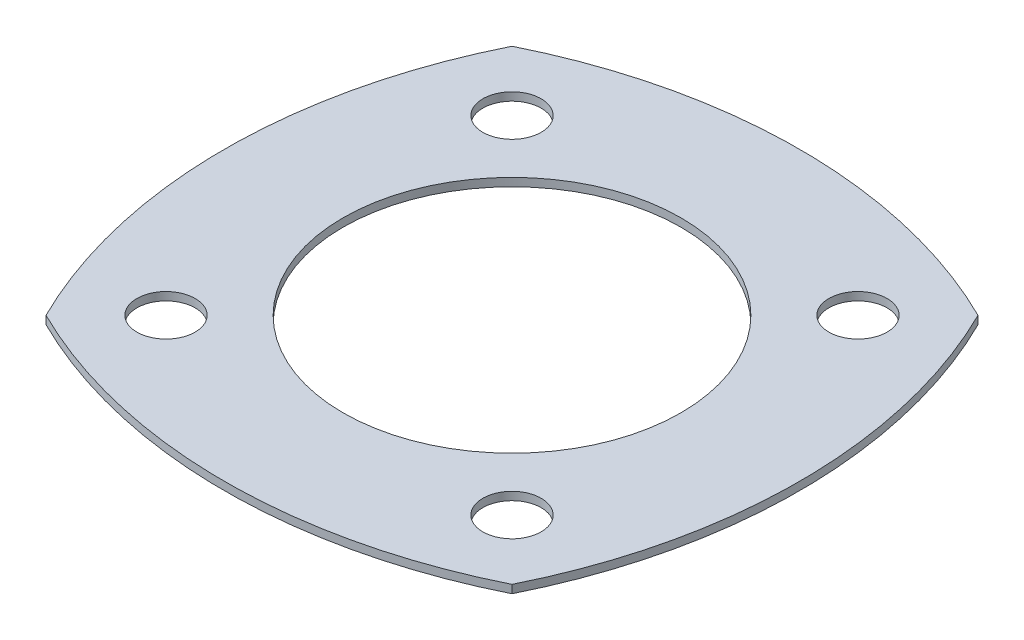
ISO-10303-21;
HEADER;
FILE_DESCRIPTION(('STEP AP214'),'2;1');
FILE_NAME('part.step','',(''),(''),'','','');
FILE_SCHEMA(('AUTOMOTIVE_DESIGN { 1 0 10303 214 1 1 1 1 }'));
ENDSEC;
DATA;
#1=APPLICATION_CONTEXT('core data for automotive mechanical design processes');
#2=APPLICATION_PROTOCOL_DEFINITION('international standard','automotive_design',2000,#1);
#3=PRODUCT_CONTEXT('',#1,'mechanical');
#4=PRODUCT('Part','Part','',(#3));
#5=PRODUCT_RELATED_PRODUCT_CATEGORY('part','',(#4));
#6=PRODUCT_DEFINITION_FORMATION('','',#4);
#7=PRODUCT_DEFINITION_CONTEXT('part definition',#1,'design');
#8=PRODUCT_DEFINITION('design','',#6,#7);
#9=PRODUCT_DEFINITION_SHAPE('','',#8);
#10=(LENGTH_UNIT() NAMED_UNIT(*) SI_UNIT(.MILLI.,.METRE.));
#11=(NAMED_UNIT(*) PLANE_ANGLE_UNIT() SI_UNIT($,.RADIAN.));
#12=(NAMED_UNIT(*) SI_UNIT($,.STERADIAN.) SOLID_ANGLE_UNIT());
#13=UNCERTAINTY_MEASURE_WITH_UNIT(LENGTH_MEASURE(1.E-05),#10,'distance_accuracy_value','');
#14=(GEOMETRIC_REPRESENTATION_CONTEXT(3) GLOBAL_UNCERTAINTY_ASSIGNED_CONTEXT((#13)) GLOBAL_UNIT_ASSIGNED_CONTEXT((#10,
#11,#12)) REPRESENTATION_CONTEXT('',''));
#15=CARTESIAN_POINT('',(0.,0.,0.));
#16=DIRECTION('',(0.,0.,1.));
#17=DIRECTION('',(1.,0.,0.));
#18=AXIS2_PLACEMENT_3D('',#15,#16,#17);
#19=CARTESIAN_POINT('',(-5.07782218537319,0.35,-5.07782218537318));
#20=DIRECTION('',(0.,1.,0.));
#21=DIRECTION('',(0.,0.,1.));
#22=AXIS2_PLACEMENT_3D('',#19,#20,#21);
#23=PLANE('',#22);
#24=CARTESIAN_POINT('',(-7.42462120245866,0.35,7.42462120245884));
#25=DIRECTION('',(0.,1.,0.));
#26=DIRECTION('',(0.,0.,1.));
#27=AXIS2_PLACEMENT_3D('',#24,#25,#26);
#28=CIRCLE('',#27,1.25);
#29=CARTESIAN_POINT('',(-7.42462120245866,0.35,8.67462120245884));
#30=VERTEX_POINT('',#29);
#31=EDGE_CURVE('E152',#30,#30,#28,.T.);
#32=ORIENTED_EDGE('',*,*,#31,.F.);
#33=EDGE_LOOP('',(#32));
#34=FACE_BOUND('',#33,.T.);
#35=CARTESIAN_POINT('',(7.42462120245871,0.35,-7.42462120245878));
#36=DIRECTION('',(0.,1.,0.));
#37=DIRECTION('',(0.,0.,1.));
#38=AXIS2_PLACEMENT_3D('',#35,#36,#37);
#39=CIRCLE('',#38,1.24999999999999);
#40=CARTESIAN_POINT('',(7.42462120245871,0.35,-6.17462120245878));
#41=VERTEX_POINT('',#40);
#42=EDGE_CURVE('E136',#41,#41,#39,.T.);
#43=ORIENTED_EDGE('',*,*,#42,.F.);
#44=EDGE_LOOP('',(#43));
#45=FACE_BOUND('',#44,.T.);
#46=CARTESIAN_POINT('',(0.,0.35,-10.1556443707464));
#47=DIRECTION('',(0.,1.,0.));
#48=DIRECTION('',(0.,0.,1.));
#49=AXIS2_PLACEMENT_3D('',#46,#47,#48);
#50=CIRCLE('',#49,22.5);
#51=CARTESIAN_POINT('',(-10.,0.35,9.99999999999999));
#52=VERTEX_POINT('',#51);
#53=CARTESIAN_POINT('',(10.,0.35,10.));
#54=VERTEX_POINT('',#53);
#55=EDGE_CURVE('E94',#52,#54,#50,.T.);
#56=ORIENTED_EDGE('',*,*,#55,.T.);
#57=CARTESIAN_POINT('',(-10.1556443707464,0.35,0.));
#58=DIRECTION('',(0.,1.,0.));
#59=DIRECTION('',(0.,0.,1.));
#60=AXIS2_PLACEMENT_3D('',#57,#58,#59);
#61=CIRCLE('',#60,22.5);
#62=CARTESIAN_POINT('',(9.99999999999999,0.35,-10.));
#63=VERTEX_POINT('',#62);
#64=EDGE_CURVE('E89',#54,#63,#61,.T.);
#65=ORIENTED_EDGE('',*,*,#64,.T.);
#66=CARTESIAN_POINT('',(0.,0.35,10.1556443707464));
#67=DIRECTION('',(0.,1.,0.));
#68=DIRECTION('',(0.,0.,1.));
#69=AXIS2_PLACEMENT_3D('',#66,#67,#68);
#70=CIRCLE('',#69,22.5);
#71=CARTESIAN_POINT('',(-10.,0.35,-10.));
#72=VERTEX_POINT('',#71);
#73=EDGE_CURVE('E92',#63,#72,#70,.T.);
#74=ORIENTED_EDGE('',*,*,#73,.T.);
#75=CARTESIAN_POINT('',(10.1556443707464,0.35,0.));
#76=DIRECTION('',(0.,1.,0.));
#77=DIRECTION('',(0.,0.,1.));
#78=AXIS2_PLACEMENT_3D('',#75,#76,#77);
#79=CIRCLE('',#78,22.5);
#80=EDGE_CURVE('E59',#72,#52,#79,.T.);
#81=ORIENTED_EDGE('',*,*,#80,.T.);
#82=EDGE_LOOP('',(#56,#65,#74,#81));
#83=FACE_BOUND('',#82,.T.);
#84=CARTESIAN_POINT('',(0.,0.35,0.));
#85=DIRECTION('',(0.,1.,0.));
#86=DIRECTION('',(0.,0.,1.));
#87=AXIS2_PLACEMENT_3D('',#84,#85,#86);
#88=CIRCLE('',#87,7.25);
#89=CARTESIAN_POINT('',(0.,0.35,7.25000000000001));
#90=VERTEX_POINT('',#89);
#91=EDGE_CURVE('E114',#90,#90,#88,.T.);
#92=ORIENTED_EDGE('',*,*,#91,.F.);
#93=EDGE_LOOP('',(#92));
#94=FACE_BOUND('',#93,.T.);
#95=CARTESIAN_POINT('',(7.42462120245875,0.35,7.42462120245874));
#96=DIRECTION('',(0.,1.,0.));
#97=DIRECTION('',(0.,0.,1.));
#98=AXIS2_PLACEMENT_3D('',#95,#96,#97);
#99=CIRCLE('',#98,1.25);
#100=CARTESIAN_POINT('',(7.42462120245875,0.35,8.67462120245875));
#101=VERTEX_POINT('',#100);
#102=EDGE_CURVE('E144',#101,#101,#99,.T.);
#103=ORIENTED_EDGE('',*,*,#102,.F.);
#104=EDGE_LOOP('',(#103));
#105=FACE_BOUND('',#104,.T.);
#106=CARTESIAN_POINT('',(-7.42462120245876,0.35,-7.42462120245873));
#107=DIRECTION('',(0.,1.,0.));
#108=DIRECTION('',(0.,0.,1.));
#109=AXIS2_PLACEMENT_3D('',#106,#107,#108);
#110=CIRCLE('',#109,1.25);
#111=CARTESIAN_POINT('',(-7.42462120245876,0.35,-6.17462120245873));
#112=VERTEX_POINT('',#111);
#113=EDGE_CURVE('E160',#112,#112,#110,.T.);
#114=ORIENTED_EDGE('',*,*,#113,.F.);
#115=EDGE_LOOP('',(#114));
#116=FACE_BOUND('',#115,.T.);
#117=ADVANCED_FACE('F41',(#34,#45,#83,#94,#105,#116),#23,.T.);
#118=CARTESIAN_POINT('',(-5.07782218537319,0.,-5.07782218537318));
#119=DIRECTION('',(0.,1.,0.));
#120=DIRECTION('',(0.,0.,1.));
#121=AXIS2_PLACEMENT_3D('',#118,#119,#120);
#122=PLANE('',#121);
#123=CARTESIAN_POINT('',(0.,0.,-10.1556443707464));
#124=DIRECTION('',(0.,1.,0.));
#125=DIRECTION('',(0.,0.,1.));
#126=AXIS2_PLACEMENT_3D('',#123,#124,#125);
#127=CIRCLE('',#126,22.5);
#128=CARTESIAN_POINT('',(-10.,0.,9.99999999999999));
#129=VERTEX_POINT('',#128);
#130=CARTESIAN_POINT('',(10.,0.,10.));
#131=VERTEX_POINT('',#130);
#132=EDGE_CURVE('E110',#129,#131,#127,.T.);
#133=ORIENTED_EDGE('',*,*,#132,.F.);
#134=CARTESIAN_POINT('',(10.1556443707464,0.,0.));
#135=DIRECTION('',(0.,1.,0.));
#136=DIRECTION('',(0.,0.,1.));
#137=AXIS2_PLACEMENT_3D('',#134,#135,#136);
#138=CIRCLE('',#137,22.5);
#139=CARTESIAN_POINT('',(-10.,0.,-10.));
#140=VERTEX_POINT('',#139);
#141=EDGE_CURVE('E82',#140,#129,#138,.T.);
#142=ORIENTED_EDGE('',*,*,#141,.F.);
#143=CARTESIAN_POINT('',(0.,0.,10.1556443707464));
#144=DIRECTION('',(0.,1.,0.));
#145=DIRECTION('',(0.,0.,1.));
#146=AXIS2_PLACEMENT_3D('',#143,#144,#145);
#147=CIRCLE('',#146,22.5);
#148=CARTESIAN_POINT('',(9.99999999999999,0.,-10.));
#149=VERTEX_POINT('',#148);
#150=EDGE_CURVE('E76',#149,#140,#147,.T.);
#151=ORIENTED_EDGE('',*,*,#150,.F.);
#152=CARTESIAN_POINT('',(-10.1556443707464,0.,0.));
#153=DIRECTION('',(0.,1.,0.));
#154=DIRECTION('',(0.,0.,1.));
#155=AXIS2_PLACEMENT_3D('',#152,#153,#154);
#156=CIRCLE('',#155,22.5);
#157=EDGE_CURVE('E99',#131,#149,#156,.T.);
#158=ORIENTED_EDGE('',*,*,#157,.F.);
#159=EDGE_LOOP('',(#133,#142,#151,#158));
#160=FACE_BOUND('',#159,.T.);
#161=CARTESIAN_POINT('',(0.,0.,0.));
#162=DIRECTION('',(0.,1.,0.));
#163=DIRECTION('',(0.,0.,1.));
#164=AXIS2_PLACEMENT_3D('',#161,#162,#163);
#165=CIRCLE('',#164,7.25);
#166=CARTESIAN_POINT('',(0.,0.,7.25000000000001));
#167=VERTEX_POINT('',#166);
#168=EDGE_CURVE('E132',#167,#167,#165,.T.);
#169=ORIENTED_EDGE('',*,*,#168,.T.);
#170=EDGE_LOOP('',(#169));
#171=FACE_BOUND('',#170,.T.);
#172=CARTESIAN_POINT('',(7.42462120245871,0.,-7.42462120245878));
#173=DIRECTION('',(0.,1.,0.));
#174=DIRECTION('',(0.,0.,1.));
#175=AXIS2_PLACEMENT_3D('',#172,#173,#174);
#176=CIRCLE('',#175,1.24999999999999);
#177=CARTESIAN_POINT('',(7.42462120245871,0.,-6.17462120245878));
#178=VERTEX_POINT('',#177);
#179=EDGE_CURVE('E140',#178,#178,#176,.T.);
#180=ORIENTED_EDGE('',*,*,#179,.T.);
#181=EDGE_LOOP('',(#180));
#182=FACE_BOUND('',#181,.T.);
#183=CARTESIAN_POINT('',(7.42462120245875,0.,7.42462120245874));
#184=DIRECTION('',(0.,1.,0.));
#185=DIRECTION('',(0.,0.,1.));
#186=AXIS2_PLACEMENT_3D('',#183,#184,#185);
#187=CIRCLE('',#186,1.25);
#188=CARTESIAN_POINT('',(7.42462120245875,0.,8.67462120245875));
#189=VERTEX_POINT('',#188);
#190=EDGE_CURVE('E148',#189,#189,#187,.T.);
#191=ORIENTED_EDGE('',*,*,#190,.T.);
#192=EDGE_LOOP('',(#191));
#193=FACE_BOUND('',#192,.T.);
#194=CARTESIAN_POINT('',(-7.42462120245866,0.,7.42462120245884));
#195=DIRECTION('',(0.,1.,0.));
#196=DIRECTION('',(0.,0.,1.));
#197=AXIS2_PLACEMENT_3D('',#194,#195,#196);
#198=CIRCLE('',#197,1.25);
#199=CARTESIAN_POINT('',(-7.42462120245866,0.,8.67462120245884));
#200=VERTEX_POINT('',#199);
#201=EDGE_CURVE('E156',#200,#200,#198,.T.);
#202=ORIENTED_EDGE('',*,*,#201,.T.);
#203=EDGE_LOOP('',(#202));
#204=FACE_BOUND('',#203,.T.);
#205=CARTESIAN_POINT('',(-7.42462120245876,0.,-7.42462120245873));
#206=DIRECTION('',(0.,1.,0.));
#207=DIRECTION('',(0.,0.,1.));
#208=AXIS2_PLACEMENT_3D('',#205,#206,#207);
#209=CIRCLE('',#208,1.25);
#210=CARTESIAN_POINT('',(-7.42462120245876,0.,-6.17462120245873));
#211=VERTEX_POINT('',#210);
#212=EDGE_CURVE('E164',#211,#211,#209,.T.);
#213=ORIENTED_EDGE('',*,*,#212,.T.);
#214=EDGE_LOOP('',(#213));
#215=FACE_BOUND('',#214,.T.);
#216=ADVANCED_FACE('F127',(#160,#171,#182,#193,#204,#215),#122,.F.);
#217=CARTESIAN_POINT('',(0.,0.35,-10.1556443707464));
#218=DIRECTION('',(0.,-1.,0.));
#219=DIRECTION('',(0.,0.,-1.));
#220=AXIS2_PLACEMENT_3D('',#217,#218,#219);
#221=CYLINDRICAL_SURFACE('',#220,22.5);
#222=ORIENTED_EDGE('',*,*,#132,.T.);
#223=DIRECTION('',(0.,-1.,0.));
#224=VECTOR('',#223,1.);
#225=CARTESIAN_POINT('',(10.,0.35,10.));
#226=LINE('',#225,#224);
#227=EDGE_CURVE('E11',#54,#131,#226,.T.);
#228=ORIENTED_EDGE('',*,*,#227,.F.);
#229=ORIENTED_EDGE('',*,*,#55,.F.);
#230=DIRECTION('',(0.,-1.,0.));
#231=VECTOR('',#230,1.);
#232=CARTESIAN_POINT('',(-10.,0.35,9.99999999999999));
#233=LINE('',#232,#231);
#234=EDGE_CURVE('E106',#52,#129,#233,.T.);
#235=ORIENTED_EDGE('',*,*,#234,.T.);
#236=EDGE_LOOP('',(#222,#228,#229,#235));
#237=FACE_BOUND('',#236,.T.);
#238=ADVANCED_FACE('F43',(#237),#221,.T.);
#239=CARTESIAN_POINT('',(-10.1556443707464,0.35,0.));
#240=DIRECTION('',(0.,-1.,0.));
#241=DIRECTION('',(0.,0.,-1.));
#242=AXIS2_PLACEMENT_3D('',#239,#240,#241);
#243=CYLINDRICAL_SURFACE('',#242,22.5);
#244=ORIENTED_EDGE('',*,*,#157,.T.);
#245=DIRECTION('',(0.,-1.,0.));
#246=VECTOR('',#245,1.);
#247=CARTESIAN_POINT('',(9.99999999999999,0.35,-10.));
#248=LINE('',#247,#246);
#249=EDGE_CURVE('E51',#63,#149,#248,.T.);
#250=ORIENTED_EDGE('',*,*,#249,.F.);
#251=ORIENTED_EDGE('',*,*,#64,.F.);
#252=ORIENTED_EDGE('',*,*,#227,.T.);
#253=EDGE_LOOP('',(#244,#250,#251,#252));
#254=FACE_BOUND('',#253,.T.);
#255=ADVANCED_FACE('F98',(#254),#243,.T.);
#256=CARTESIAN_POINT('',(0.,0.35,10.1556443707464));
#257=DIRECTION('',(0.,-1.,0.));
#258=DIRECTION('',(0.,0.,-1.));
#259=AXIS2_PLACEMENT_3D('',#256,#257,#258);
#260=CYLINDRICAL_SURFACE('',#259,22.5);
#261=ORIENTED_EDGE('',*,*,#150,.T.);
#262=DIRECTION('',(0.,-1.,0.));
#263=VECTOR('',#262,1.);
#264=CARTESIAN_POINT('',(-10.,0.35,-10.));
#265=LINE('',#264,#263);
#266=EDGE_CURVE('E101',#72,#140,#265,.T.);
#267=ORIENTED_EDGE('',*,*,#266,.F.);
#268=ORIENTED_EDGE('',*,*,#73,.F.);
#269=ORIENTED_EDGE('',*,*,#249,.T.);
#270=EDGE_LOOP('',(#261,#267,#268,#269));
#271=FACE_BOUND('',#270,.T.);
#272=ADVANCED_FACE('F102',(#271),#260,.T.);
#273=CARTESIAN_POINT('',(10.1556443707464,0.35,0.));
#274=DIRECTION('',(0.,-1.,0.));
#275=DIRECTION('',(0.,0.,-1.));
#276=AXIS2_PLACEMENT_3D('',#273,#274,#275);
#277=CYLINDRICAL_SURFACE('',#276,22.5);
#278=ORIENTED_EDGE('',*,*,#141,.T.);
#279=ORIENTED_EDGE('',*,*,#234,.F.);
#280=ORIENTED_EDGE('',*,*,#80,.F.);
#281=ORIENTED_EDGE('',*,*,#266,.T.);
#282=EDGE_LOOP('',(#278,#279,#280,#281));
#283=FACE_BOUND('',#282,.T.);
#284=ADVANCED_FACE('F124',(#283),#277,.T.);
#285=CARTESIAN_POINT('',(0.,0.35,0.));
#286=DIRECTION('',(0.,-1.,0.));
#287=DIRECTION('',(0.,0.,-1.));
#288=AXIS2_PLACEMENT_3D('',#285,#286,#287);
#289=CYLINDRICAL_SURFACE('',#288,7.25);
#290=ORIENTED_EDGE('',*,*,#91,.T.);
#291=EDGE_LOOP('',(#290));
#292=FACE_BOUND('',#291,.T.);
#293=ORIENTED_EDGE('',*,*,#168,.F.);
#294=EDGE_LOOP('',(#293));
#295=FACE_BOUND('',#294,.T.);
#296=ADVANCED_FACE('F185',(#292,#295),#289,.F.);
#297=CARTESIAN_POINT('',(7.42462120245871,0.35,-7.42462120245878));
#298=DIRECTION('',(0.,-1.,0.));
#299=DIRECTION('',(0.,0.,-1.));
#300=AXIS2_PLACEMENT_3D('',#297,#298,#299);
#301=CYLINDRICAL_SURFACE('',#300,1.24999999999999);
#302=ORIENTED_EDGE('',*,*,#42,.T.);
#303=EDGE_LOOP('',(#302));
#304=FACE_BOUND('',#303,.T.);
#305=ORIENTED_EDGE('',*,*,#179,.F.);
#306=EDGE_LOOP('',(#305));
#307=FACE_BOUND('',#306,.T.);
#308=ADVANCED_FACE('F231',(#304,#307),#301,.F.);
#309=CARTESIAN_POINT('',(7.42462120245875,0.35,7.42462120245874));
#310=DIRECTION('',(0.,-1.,0.));
#311=DIRECTION('',(0.,0.,-1.));
#312=AXIS2_PLACEMENT_3D('',#309,#310,#311);
#313=CYLINDRICAL_SURFACE('',#312,1.25);
#314=ORIENTED_EDGE('',*,*,#102,.T.);
#315=EDGE_LOOP('',(#314));
#316=FACE_BOUND('',#315,.T.);
#317=ORIENTED_EDGE('',*,*,#190,.F.);
#318=EDGE_LOOP('',(#317));
#319=FACE_BOUND('',#318,.T.);
#320=ADVANCED_FACE('F239',(#316,#319),#313,.F.);
#321=CARTESIAN_POINT('',(-7.42462120245866,0.35,7.42462120245884));
#322=DIRECTION('',(0.,-1.,0.));
#323=DIRECTION('',(0.,0.,-1.));
#324=AXIS2_PLACEMENT_3D('',#321,#322,#323);
#325=CYLINDRICAL_SURFACE('',#324,1.25);
#326=ORIENTED_EDGE('',*,*,#31,.T.);
#327=EDGE_LOOP('',(#326));
#328=FACE_BOUND('',#327,.T.);
#329=ORIENTED_EDGE('',*,*,#201,.F.);
#330=EDGE_LOOP('',(#329));
#331=FACE_BOUND('',#330,.T.);
#332=ADVANCED_FACE('F247',(#328,#331),#325,.F.);
#333=CARTESIAN_POINT('',(-7.42462120245876,0.35,-7.42462120245873));
#334=DIRECTION('',(0.,-1.,0.));
#335=DIRECTION('',(0.,0.,-1.));
#336=AXIS2_PLACEMENT_3D('',#333,#334,#335);
#337=CYLINDRICAL_SURFACE('',#336,1.25);
#338=ORIENTED_EDGE('',*,*,#113,.T.);
#339=EDGE_LOOP('',(#338));
#340=FACE_BOUND('',#339,.T.);
#341=ORIENTED_EDGE('',*,*,#212,.F.);
#342=EDGE_LOOP('',(#341));
#343=FACE_BOUND('',#342,.T.);
#344=ADVANCED_FACE('F172',(#340,#343),#337,.F.);
#345=CLOSED_SHELL('',(#117,#216,#238,#255,#272,#284,#296,#308,#320,#332,#344));
#346=MANIFOLD_SOLID_BREP('B2',#345);
#347=ADVANCED_BREP_SHAPE_REPRESENTATION('',(#18,#346),#14);
#348=SHAPE_DEFINITION_REPRESENTATION(#9,#347);
ENDSEC;
END-ISO-10303-21;
